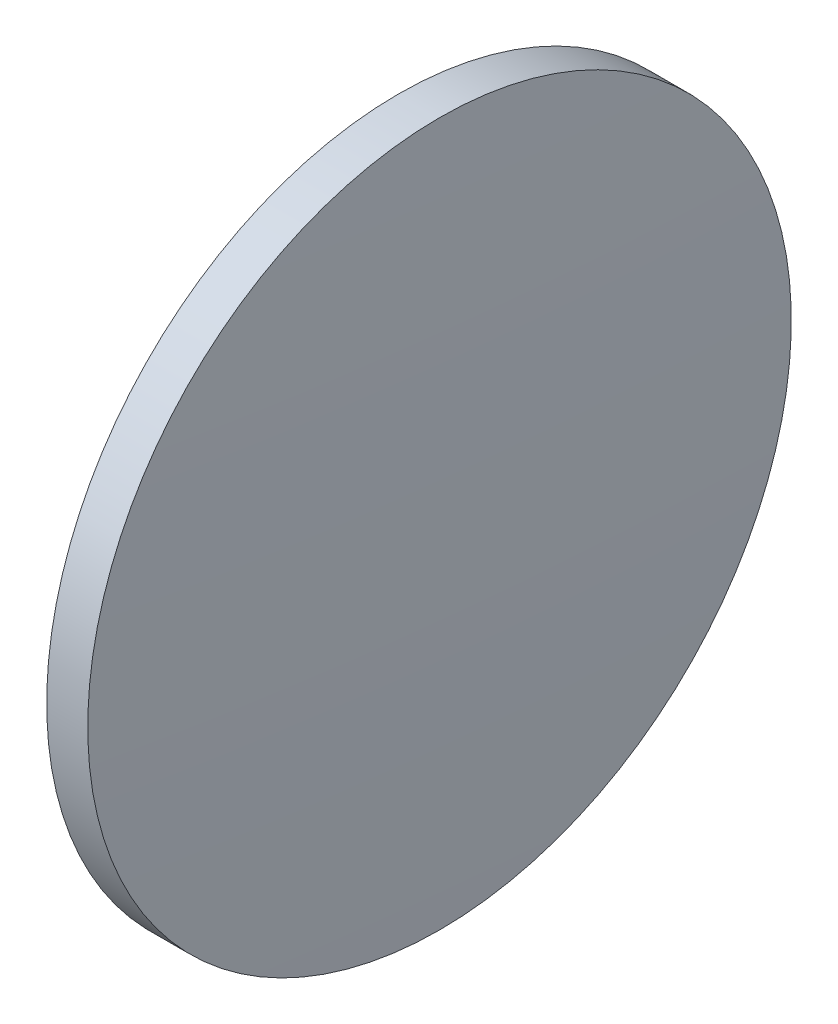
ISO-10303-21;
HEADER;
FILE_DESCRIPTION(('STEP AP214'),'2;1');
FILE_NAME('part.step','',(''),(''),'','','');
FILE_SCHEMA(('AUTOMOTIVE_DESIGN { 1 0 10303 214 1 1 1 1 }'));
ENDSEC;
DATA;
#1=APPLICATION_CONTEXT('core data for automotive mechanical design processes');
#2=APPLICATION_PROTOCOL_DEFINITION('international standard','automotive_design',2000,#1);
#3=PRODUCT_CONTEXT('',#1,'mechanical');
#4=PRODUCT('Part','Part','',(#3));
#5=PRODUCT_RELATED_PRODUCT_CATEGORY('part','',(#4));
#6=PRODUCT_DEFINITION_FORMATION('','',#4);
#7=PRODUCT_DEFINITION_CONTEXT('part definition',#1,'design');
#8=PRODUCT_DEFINITION('design','',#6,#7);
#9=PRODUCT_DEFINITION_SHAPE('','',#8);
#10=(LENGTH_UNIT() NAMED_UNIT(*) SI_UNIT(.MILLI.,.METRE.));
#11=(NAMED_UNIT(*) PLANE_ANGLE_UNIT() SI_UNIT($,.RADIAN.));
#12=(NAMED_UNIT(*) SI_UNIT($,.STERADIAN.) SOLID_ANGLE_UNIT());
#13=UNCERTAINTY_MEASURE_WITH_UNIT(LENGTH_MEASURE(1.E-05),#10,'distance_accuracy_value','');
#14=(GEOMETRIC_REPRESENTATION_CONTEXT(3) GLOBAL_UNCERTAINTY_ASSIGNED_CONTEXT((#13)) GLOBAL_UNIT_ASSIGNED_CONTEXT((#10,
#11,#12)) REPRESENTATION_CONTEXT('',''));
#15=CARTESIAN_POINT('',(0.,0.,0.));
#16=DIRECTION('',(0.,0.,1.));
#17=DIRECTION('',(1.,0.,0.));
#18=AXIS2_PLACEMENT_3D('',#15,#16,#17);
#19=CARTESIAN_POINT('',(-684.443582159197,0.544580492999102,0.855301037688605));
#20=DIRECTION('',(1.,0.,0.));
#21=DIRECTION('',(0.,1.,0.));
#22=AXIS2_PLACEMENT_3D('',#19,#20,#21);
#23=SPHERICAL_SURFACE('',#22,689.5);
#24=CARTESIAN_POINT('',(4.58841274379768,0.544580492999102,0.855301037688605));
#25=DIRECTION('',(1.,0.,0.));
#26=DIRECTION('',(0.,1.,0.));
#27=AXIS2_PLACEMENT_3D('',#24,#25,#26);
#28=CIRCLE('',#27,25.4);
#29=CARTESIAN_POINT('',(4.58841274379768,25.9445804929991,0.855301037688605));
#30=VERTEX_POINT('',#29);
#31=EDGE_CURVE('E8',#30,#30,#28,.T.);
#32=ORIENTED_EDGE('',*,*,#31,.T.);
#33=EDGE_LOOP('',(#32));
#34=FACE_BOUND('',#33,.T.);
#35=ADVANCED_FACE('F13',(#34),#23,.T.);
#36=CARTESIAN_POINT('',(5.05641784080326,0.544580492999102,0.855301037688605));
#37=DIRECTION('',(1.,0.,0.));
#38=DIRECTION('',(0.,1.,0.));
#39=AXIS2_PLACEMENT_3D('',#36,#37,#38);
#40=CYLINDRICAL_SURFACE('',#39,25.4);
#41=CARTESIAN_POINT('',(1.6244229378089,0.544580492999102,0.855301037688605));
#42=DIRECTION('',(1.,0.,0.));
#43=DIRECTION('',(0.,1.,0.));
#44=AXIS2_PLACEMENT_3D('',#41,#42,#43);
#45=CIRCLE('',#44,25.3999999999999);
#46=CARTESIAN_POINT('',(1.6244229378089,25.944580492999,0.855301037688605));
#47=VERTEX_POINT('',#46);
#48=EDGE_CURVE('E19',#47,#47,#45,.T.);
#49=ORIENTED_EDGE('',*,*,#48,.T.);
#50=EDGE_LOOP('',(#49));
#51=FACE_BOUND('',#50,.T.);
#52=ORIENTED_EDGE('',*,*,#31,.F.);
#53=EDGE_LOOP('',(#52));
#54=FACE_BOUND('',#53,.T.);
#55=ADVANCED_FACE('F25',(#51,#54),#40,.T.);
#56=CARTESIAN_POINT('',(690.656417840803,0.544580492999102,0.855301037688605));
#57=DIRECTION('',(1.,0.,0.));
#58=DIRECTION('',(0.,1.,0.));
#59=AXIS2_PLACEMENT_3D('',#56,#57,#58);
#60=SPHERICAL_SURFACE('',#59,689.5);
#61=ORIENTED_EDGE('',*,*,#48,.F.);
#62=EDGE_LOOP('',(#61));
#63=FACE_BOUND('',#62,.T.);
#64=ADVANCED_FACE('F28',(#63),#60,.T.);
#65=CLOSED_SHELL('',(#35,#55,#64));
#66=MANIFOLD_SOLID_BREP('B1',#65);
#67=ADVANCED_BREP_SHAPE_REPRESENTATION('',(#18,#66),#14);
#68=SHAPE_DEFINITION_REPRESENTATION(#9,#67);
ENDSEC;
END-ISO-10303-21;
